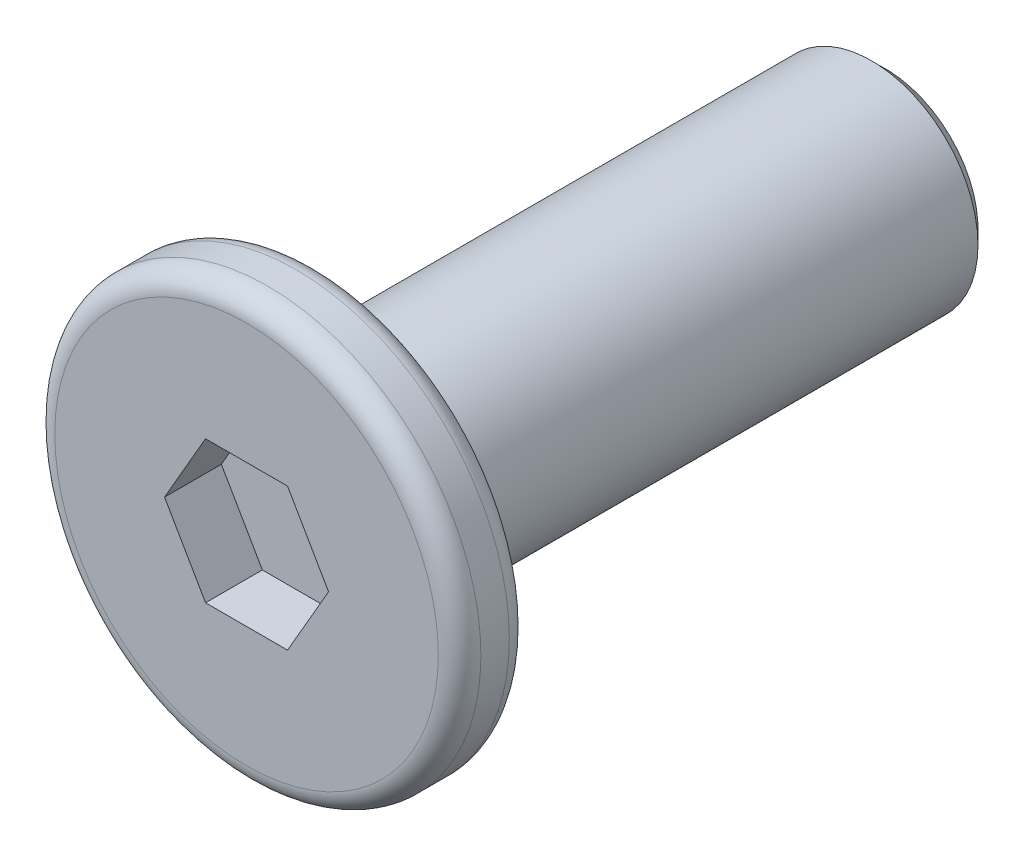
ISO-10303-21;
HEADER;
FILE_DESCRIPTION(('STEP AP214'),'2;1');
FILE_NAME('part.step','',(''),(''),'','','');
FILE_SCHEMA(('AUTOMOTIVE_DESIGN { 1 0 10303 214 1 1 1 1 }'));
ENDSEC;
DATA;
#1=APPLICATION_CONTEXT('core data for automotive mechanical design processes');
#2=APPLICATION_PROTOCOL_DEFINITION('international standard','automotive_design',2000,#1);
#3=PRODUCT_CONTEXT('',#1,'mechanical');
#4=PRODUCT('Part','Part','',(#3));
#5=PRODUCT_RELATED_PRODUCT_CATEGORY('part','',(#4));
#6=PRODUCT_DEFINITION_FORMATION('','',#4);
#7=PRODUCT_DEFINITION_CONTEXT('part definition',#1,'design');
#8=PRODUCT_DEFINITION('design','',#6,#7);
#9=PRODUCT_DEFINITION_SHAPE('','',#8);
#10=(LENGTH_UNIT() NAMED_UNIT(*) SI_UNIT(.MILLI.,.METRE.));
#11=(NAMED_UNIT(*) PLANE_ANGLE_UNIT() SI_UNIT($,.RADIAN.));
#12=(NAMED_UNIT(*) SI_UNIT($,.STERADIAN.) SOLID_ANGLE_UNIT());
#13=UNCERTAINTY_MEASURE_WITH_UNIT(LENGTH_MEASURE(1.E-05),#10,'distance_accuracy_value','');
#14=(GEOMETRIC_REPRESENTATION_CONTEXT(3) GLOBAL_UNCERTAINTY_ASSIGNED_CONTEXT((#13)) GLOBAL_UNIT_ASSIGNED_CONTEXT((#10,
#11,#12)) REPRESENTATION_CONTEXT('',''));
#15=CARTESIAN_POINT('',(0.,0.,0.));
#16=DIRECTION('',(0.,0.,1.));
#17=DIRECTION('',(1.,0.,0.));
#18=AXIS2_PLACEMENT_3D('',#15,#16,#17);
#19=CARTESIAN_POINT('',(0.,0.,0.5));
#20=DIRECTION('',(0.,0.,-1.));
#21=DIRECTION('',(-1.,0.,0.));
#22=AXIS2_PLACEMENT_3D('',#19,#20,#21);
#23=CYLINDRICAL_SURFACE('',#22,3.);
#24=CARTESIAN_POINT('',(0.,0.,-0.2));
#25=DIRECTION('',(0.,0.,1.));
#26=DIRECTION('',(1.,0.,0.));
#27=AXIS2_PLACEMENT_3D('',#24,#25,#26);
#28=CIRCLE('',#27,3.);
#29=CARTESIAN_POINT('',(3.,0.,-0.2));
#30=VERTEX_POINT('',#29);
#31=EDGE_CURVE('E154',#30,#30,#28,.T.);
#32=ORIENTED_EDGE('',*,*,#31,.T.);
#33=EDGE_LOOP('',(#32));
#34=FACE_BOUND('',#33,.T.);
#35=CARTESIAN_POINT('',(0.,0.,0.2));
#36=DIRECTION('',(0.,0.,1.));
#37=DIRECTION('',(1.,0.,0.));
#38=AXIS2_PLACEMENT_3D('',#35,#36,#37);
#39=CIRCLE('',#38,3.);
#40=CARTESIAN_POINT('',(3.,0.,0.2));
#41=VERTEX_POINT('',#40);
#42=EDGE_CURVE('E151',#41,#41,#39,.F.);
#43=ORIENTED_EDGE('',*,*,#42,.T.);
#44=EDGE_LOOP('',(#43));
#45=FACE_BOUND('',#44,.T.);
#46=ADVANCED_FACE('F35',(#34,#45),#23,.T.);
#47=CARTESIAN_POINT('',(0.,0.,0.5));
#48=DIRECTION('',(0.,0.,1.));
#49=DIRECTION('',(1.,0.,0.));
#50=AXIS2_PLACEMENT_3D('',#47,#48,#49);
#51=PLANE('',#50);
#52=CARTESIAN_POINT('',(0.,0.,0.5));
#53=DIRECTION('',(0.,0.,1.));
#54=DIRECTION('',(1.,0.,0.));
#55=AXIS2_PLACEMENT_3D('',#52,#53,#54);
#56=CIRCLE('',#55,2.7);
#57=CARTESIAN_POINT('',(2.7,0.,0.5));
#58=VERTEX_POINT('',#57);
#59=EDGE_CURVE('E11',#58,#58,#56,.T.);
#60=ORIENTED_EDGE('',*,*,#59,.T.);
#61=EDGE_LOOP('',(#60));
#62=FACE_BOUND('',#61,.T.);
#63=DIRECTION('',(0.5,0.866025403784439,0.));
#64=VECTOR('',#63,1.);
#65=CARTESIAN_POINT('',(0.577350269189626,-1.,0.5));
#66=LINE('',#65,#64);
#67=CARTESIAN_POINT('',(0.577350269189626,-1.,0.5));
#68=VERTEX_POINT('',#67);
#69=CARTESIAN_POINT('',(1.15470053837925,0.,0.5));
#70=VERTEX_POINT('',#69);
#71=EDGE_CURVE('E50',#68,#70,#66,.T.);
#72=ORIENTED_EDGE('',*,*,#71,.F.);
#73=DIRECTION('',(1.,0.,0.));
#74=VECTOR('',#73,1.);
#75=CARTESIAN_POINT('',(-0.577350269189625,-1.,0.5));
#76=LINE('',#75,#74);
#77=CARTESIAN_POINT('',(-0.577350269189625,-1.,0.5));
#78=VERTEX_POINT('',#77);
#79=EDGE_CURVE('E133',#78,#68,#76,.T.);
#80=ORIENTED_EDGE('',*,*,#79,.F.);
#81=DIRECTION('',(0.5,-0.866025403784438,0.));
#82=VECTOR('',#81,1.);
#83=CARTESIAN_POINT('',(-1.15470053837925,0.,0.5));
#84=LINE('',#83,#82);
#85=CARTESIAN_POINT('',(-1.15470053837925,0.,0.5));
#86=VERTEX_POINT('',#85);
#87=EDGE_CURVE('E131',#86,#78,#84,.T.);
#88=ORIENTED_EDGE('',*,*,#87,.F.);
#89=DIRECTION('',(-0.5,-0.866025403784438,0.));
#90=VECTOR('',#89,1.);
#91=CARTESIAN_POINT('',(-0.577350269189626,1.,0.5));
#92=LINE('',#91,#90);
#93=CARTESIAN_POINT('',(-0.577350269189626,1.,0.5));
#94=VERTEX_POINT('',#93);
#95=EDGE_CURVE('E98',#94,#86,#92,.T.);
#96=ORIENTED_EDGE('',*,*,#95,.F.);
#97=DIRECTION('',(-1.,0.,0.));
#98=VECTOR('',#97,1.);
#99=CARTESIAN_POINT('',(0.577350269189625,1.,0.5));
#100=LINE('',#99,#98);
#101=CARTESIAN_POINT('',(0.577350269189625,1.,0.5));
#102=VERTEX_POINT('',#101);
#103=EDGE_CURVE('E127',#102,#94,#100,.T.);
#104=ORIENTED_EDGE('',*,*,#103,.F.);
#105=DIRECTION('',(-0.5,0.866025403784438,0.));
#106=VECTOR('',#105,1.);
#107=CARTESIAN_POINT('',(1.15470053837925,0.,0.5));
#108=LINE('',#107,#106);
#109=EDGE_CURVE('E124',#70,#102,#108,.T.);
#110=ORIENTED_EDGE('',*,*,#109,.F.);
#111=EDGE_LOOP('',(#72,#80,#88,#96,#104,#110));
#112=FACE_BOUND('',#111,.T.);
#113=ADVANCED_FACE('F169',(#62,#112),#51,.T.);
#114=CARTESIAN_POINT('',(0.,0.,-0.5));
#115=DIRECTION('',(0.,0.,1.));
#116=DIRECTION('',(1.,0.,0.));
#117=AXIS2_PLACEMENT_3D('',#114,#115,#116);
#118=PLANE('',#117);
#119=CARTESIAN_POINT('',(0.,0.,-0.5));
#120=DIRECTION('',(0.,0.,1.));
#121=DIRECTION('',(1.,0.,0.));
#122=AXIS2_PLACEMENT_3D('',#119,#120,#121);
#123=CIRCLE('',#122,2.7);
#124=CARTESIAN_POINT('',(2.7,0.,-0.5));
#125=VERTEX_POINT('',#124);
#126=EDGE_CURVE('E43',#125,#125,#123,.F.);
#127=ORIENTED_EDGE('',*,*,#126,.T.);
#128=EDGE_LOOP('',(#127));
#129=FACE_BOUND('',#128,.T.);
#130=CARTESIAN_POINT('',(0.,0.,-0.5));
#131=DIRECTION('',(0.,0.,-1.));
#132=DIRECTION('',(-1.,0.,0.));
#133=AXIS2_PLACEMENT_3D('',#130,#131,#132);
#134=CIRCLE('',#133,1.5);
#135=CARTESIAN_POINT('',(-1.5,0.,-0.5));
#136=VERTEX_POINT('',#135);
#137=EDGE_CURVE('E137',#136,#136,#134,.T.);
#138=ORIENTED_EDGE('',*,*,#137,.F.);
#139=EDGE_LOOP('',(#138));
#140=FACE_BOUND('',#139,.T.);
#141=ADVANCED_FACE('F159',(#129,#140),#118,.F.);
#142=CARTESIAN_POINT('',(0.,0.,-8.5));
#143=DIRECTION('',(0.,0.,1.));
#144=DIRECTION('',(1.,0.,0.));
#145=AXIS2_PLACEMENT_3D('',#142,#143,#144);
#146=CYLINDRICAL_SURFACE('',#145,1.5);
#147=CARTESIAN_POINT('',(0.,0.,-8.3));
#148=DIRECTION('',(0.,0.,-1.));
#149=DIRECTION('',(-1.,0.,0.));
#150=AXIS2_PLACEMENT_3D('',#147,#148,#149);
#151=CIRCLE('',#150,1.5);
#152=CARTESIAN_POINT('',(-1.5,0.,-8.3));
#153=VERTEX_POINT('',#152);
#154=EDGE_CURVE('E148',#153,#153,#151,.F.);
#155=ORIENTED_EDGE('',*,*,#154,.T.);
#156=EDGE_LOOP('',(#155));
#157=FACE_BOUND('',#156,.T.);
#158=ORIENTED_EDGE('',*,*,#137,.T.);
#159=EDGE_LOOP('',(#158));
#160=FACE_BOUND('',#159,.T.);
#161=ADVANCED_FACE('F204',(#157,#160),#146,.T.);
#162=CARTESIAN_POINT('',(0.,0.,-8.5));
#163=DIRECTION('',(0.,0.,-1.));
#164=DIRECTION('',(-1.,0.,0.));
#165=AXIS2_PLACEMENT_3D('',#162,#163,#164);
#166=PLANE('',#165);
#167=CARTESIAN_POINT('',(0.,0.,-8.5));
#168=DIRECTION('',(0.,0.,-1.));
#169=DIRECTION('',(-1.,0.,0.));
#170=AXIS2_PLACEMENT_3D('',#167,#168,#169);
#171=CIRCLE('',#170,1.3);
#172=CARTESIAN_POINT('',(-1.3,0.,-8.5));
#173=VERTEX_POINT('',#172);
#174=EDGE_CURVE('E145',#173,#173,#171,.T.);
#175=ORIENTED_EDGE('',*,*,#174,.T.);
#176=EDGE_LOOP('',(#175));
#177=FACE_BOUND('',#176,.T.);
#178=ADVANCED_FACE('F196',(#177),#166,.T.);
#179=CARTESIAN_POINT('',(0.,0.,-8.5));
#180=DIRECTION('',(0.,0.,1.));
#181=DIRECTION('',(1.,0.,0.));
#182=AXIS2_PLACEMENT_3D('',#179,#180,#181);
#183=CONICAL_SURFACE('',#182,1.3,0.78539816339745);
#184=ORIENTED_EDGE('',*,*,#154,.F.);
#185=EDGE_LOOP('',(#184));
#186=FACE_BOUND('',#185,.T.);
#187=ORIENTED_EDGE('',*,*,#174,.F.);
#188=EDGE_LOOP('',(#187));
#189=FACE_BOUND('',#188,.T.);
#190=ADVANCED_FACE('F189',(#186,#189),#183,.T.);
#191=CARTESIAN_POINT('',(0.577350269189626,-1.,-0.3));
#192=DIRECTION('',(0.866025403784439,-0.5,0.));
#193=DIRECTION('',(0.5,0.866025403784439,0.));
#194=AXIS2_PLACEMENT_3D('',#191,#192,#193);
#195=PLANE('',#194);
#196=ORIENTED_EDGE('',*,*,#71,.T.);
#197=DIRECTION('',(0.,0.,1.));
#198=VECTOR('',#197,1.);
#199=CARTESIAN_POINT('',(1.15470053837925,0.,-0.3));
#200=LINE('',#199,#198);
#201=CARTESIAN_POINT('',(1.15470053837925,0.,-0.3));
#202=VERTEX_POINT('',#201);
#203=EDGE_CURVE('E80',#202,#70,#200,.T.);
#204=ORIENTED_EDGE('',*,*,#203,.F.);
#205=DIRECTION('',(0.5,0.866025403784439,0.));
#206=VECTOR('',#205,1.);
#207=CARTESIAN_POINT('',(0.577350269189626,-1.,-0.3));
#208=LINE('',#207,#206);
#209=CARTESIAN_POINT('',(0.577350269189626,-1.,-0.3));
#210=VERTEX_POINT('',#209);
#211=EDGE_CURVE('E135',#210,#202,#208,.T.);
#212=ORIENTED_EDGE('',*,*,#211,.F.);
#213=DIRECTION('',(0.,0.,1.));
#214=VECTOR('',#213,1.);
#215=CARTESIAN_POINT('',(0.577350269189626,-1.,-0.3));
#216=LINE('',#215,#214);
#217=EDGE_CURVE('E58',#210,#68,#216,.T.);
#218=ORIENTED_EDGE('',*,*,#217,.T.);
#219=EDGE_LOOP('',(#196,#204,#212,#218));
#220=FACE_BOUND('',#219,.T.);
#221=ADVANCED_FACE('F186',(#220),#195,.F.);
#222=CARTESIAN_POINT('',(-0.577350269189625,-1.,-0.3));
#223=DIRECTION('',(0.,-1.,0.));
#224=DIRECTION('',(1.,0.,0.));
#225=AXIS2_PLACEMENT_3D('',#222,#223,#224);
#226=PLANE('',#225);
#227=ORIENTED_EDGE('',*,*,#79,.T.);
#228=ORIENTED_EDGE('',*,*,#217,.F.);
#229=DIRECTION('',(1.,0.,0.));
#230=VECTOR('',#229,1.);
#231=CARTESIAN_POINT('',(-0.577350269189625,-1.,-0.3));
#232=LINE('',#231,#230);
#233=CARTESIAN_POINT('',(-0.577350269189625,-1.,-0.3));
#234=VERTEX_POINT('',#233);
#235=EDGE_CURVE('E110',#234,#210,#232,.T.);
#236=ORIENTED_EDGE('',*,*,#235,.F.);
#237=DIRECTION('',(0.,0.,1.));
#238=VECTOR('',#237,1.);
#239=CARTESIAN_POINT('',(-0.577350269189625,-1.,-0.3));
#240=LINE('',#239,#238);
#241=EDGE_CURVE('E102',#234,#78,#240,.T.);
#242=ORIENTED_EDGE('',*,*,#241,.T.);
#243=EDGE_LOOP('',(#227,#228,#236,#242));
#244=FACE_BOUND('',#243,.T.);
#245=ADVANCED_FACE('F188',(#244),#226,.F.);
#246=CARTESIAN_POINT('',(-1.15470053837925,0.,-0.3));
#247=DIRECTION('',(-0.866025403784438,-0.5,0.));
#248=DIRECTION('',(0.5,-0.866025403784438,0.));
#249=AXIS2_PLACEMENT_3D('',#246,#247,#248);
#250=PLANE('',#249);
#251=ORIENTED_EDGE('',*,*,#87,.T.);
#252=ORIENTED_EDGE('',*,*,#241,.F.);
#253=DIRECTION('',(0.5,-0.866025403784438,0.));
#254=VECTOR('',#253,1.);
#255=CARTESIAN_POINT('',(-1.15470053837925,0.,-0.3));
#256=LINE('',#255,#254);
#257=CARTESIAN_POINT('',(-1.15470053837925,0.,-0.3));
#258=VERTEX_POINT('',#257);
#259=EDGE_CURVE('E106',#258,#234,#256,.T.);
#260=ORIENTED_EDGE('',*,*,#259,.F.);
#261=DIRECTION('',(0.,0.,1.));
#262=VECTOR('',#261,1.);
#263=CARTESIAN_POINT('',(-1.15470053837925,0.,-0.3));
#264=LINE('',#263,#262);
#265=EDGE_CURVE('E91',#258,#86,#264,.T.);
#266=ORIENTED_EDGE('',*,*,#265,.T.);
#267=EDGE_LOOP('',(#251,#252,#260,#266));
#268=FACE_BOUND('',#267,.T.);
#269=ADVANCED_FACE('F107',(#268),#250,.F.);
#270=CARTESIAN_POINT('',(-0.577350269189626,1.,-0.3));
#271=DIRECTION('',(-0.866025403784438,0.5,0.));
#272=DIRECTION('',(-0.5,-0.866025403784439,0.));
#273=AXIS2_PLACEMENT_3D('',#270,#271,#272);
#274=PLANE('',#273);
#275=ORIENTED_EDGE('',*,*,#95,.T.);
#276=ORIENTED_EDGE('',*,*,#265,.F.);
#277=DIRECTION('',(-0.5,-0.866025403784438,0.));
#278=VECTOR('',#277,1.);
#279=CARTESIAN_POINT('',(-0.577350269189626,1.,-0.3));
#280=LINE('',#279,#278);
#281=CARTESIAN_POINT('',(-0.577350269189626,1.,-0.3));
#282=VERTEX_POINT('',#281);
#283=EDGE_CURVE('E95',#282,#258,#280,.T.);
#284=ORIENTED_EDGE('',*,*,#283,.F.);
#285=DIRECTION('',(0.,0.,1.));
#286=VECTOR('',#285,1.);
#287=CARTESIAN_POINT('',(-0.577350269189626,1.,-0.3));
#288=LINE('',#287,#286);
#289=EDGE_CURVE('E103',#282,#94,#288,.T.);
#290=ORIENTED_EDGE('',*,*,#289,.T.);
#291=EDGE_LOOP('',(#275,#276,#284,#290));
#292=FACE_BOUND('',#291,.T.);
#293=ADVANCED_FACE('F93',(#292),#274,.F.);
#294=CARTESIAN_POINT('',(0.577350269189625,1.,-0.3));
#295=DIRECTION('',(0.,1.,0.));
#296=DIRECTION('',(0.,0.,1.));
#297=AXIS2_PLACEMENT_3D('',#294,#295,#296);
#298=PLANE('',#297);
#299=ORIENTED_EDGE('',*,*,#103,.T.);
#300=ORIENTED_EDGE('',*,*,#289,.F.);
#301=DIRECTION('',(-1.,0.,0.));
#302=VECTOR('',#301,1.);
#303=CARTESIAN_POINT('',(0.577350269189625,1.,-0.3));
#304=LINE('',#303,#302);
#305=CARTESIAN_POINT('',(0.577350269189625,1.,-0.3));
#306=VERTEX_POINT('',#305);
#307=EDGE_CURVE('E116',#306,#282,#304,.T.);
#308=ORIENTED_EDGE('',*,*,#307,.F.);
#309=DIRECTION('',(0.,0.,1.));
#310=VECTOR('',#309,1.);
#311=CARTESIAN_POINT('',(0.577350269189625,1.,-0.3));
#312=LINE('',#311,#310);
#313=EDGE_CURVE('E140',#306,#102,#312,.T.);
#314=ORIENTED_EDGE('',*,*,#313,.T.);
#315=EDGE_LOOP('',(#299,#300,#308,#314));
#316=FACE_BOUND('',#315,.T.);
#317=ADVANCED_FACE('F257',(#316),#298,.F.);
#318=CARTESIAN_POINT('',(1.15470053837925,0.,-0.3));
#319=DIRECTION('',(0.866025403784438,0.5,0.));
#320=DIRECTION('',(-0.5,0.866025403784439,0.));
#321=AXIS2_PLACEMENT_3D('',#318,#319,#320);
#322=PLANE('',#321);
#323=ORIENTED_EDGE('',*,*,#109,.T.);
#324=ORIENTED_EDGE('',*,*,#313,.F.);
#325=DIRECTION('',(-0.5,0.866025403784438,0.));
#326=VECTOR('',#325,1.);
#327=CARTESIAN_POINT('',(1.15470053837925,0.,-0.3));
#328=LINE('',#327,#326);
#329=EDGE_CURVE('E118',#202,#306,#328,.T.);
#330=ORIENTED_EDGE('',*,*,#329,.F.);
#331=ORIENTED_EDGE('',*,*,#203,.T.);
#332=EDGE_LOOP('',(#323,#324,#330,#331));
#333=FACE_BOUND('',#332,.T.);
#334=ADVANCED_FACE('F184',(#333),#322,.F.);
#335=CARTESIAN_POINT('',(0.,0.,-0.3));
#336=DIRECTION('',(0.,0.,1.));
#337=DIRECTION('',(1.,0.,0.));
#338=AXIS2_PLACEMENT_3D('',#335,#336,#337);
#339=PLANE('',#338);
#340=ORIENTED_EDGE('',*,*,#211,.T.);
#341=ORIENTED_EDGE('',*,*,#329,.T.);
#342=ORIENTED_EDGE('',*,*,#307,.T.);
#343=ORIENTED_EDGE('',*,*,#283,.T.);
#344=ORIENTED_EDGE('',*,*,#259,.T.);
#345=ORIENTED_EDGE('',*,*,#235,.T.);
#346=EDGE_LOOP('',(#340,#341,#342,#343,#344,#345));
#347=FACE_BOUND('',#346,.T.);
#348=ADVANCED_FACE('F113',(#347),#339,.T.);
#349=CARTESIAN_POINT('',(0.,0.,-0.2));
#350=DIRECTION('',(0.,0.,1.));
#351=DIRECTION('',(1.,0.,0.));
#352=AXIS2_PLACEMENT_3D('',#349,#350,#351);
#353=TOROIDAL_SURFACE('',#352,2.7,0.3);
#354=ORIENTED_EDGE('',*,*,#126,.F.);
#355=EDGE_LOOP('',(#354));
#356=FACE_BOUND('',#355,.T.);
#357=ORIENTED_EDGE('',*,*,#31,.F.);
#358=EDGE_LOOP('',(#357));
#359=FACE_BOUND('',#358,.T.);
#360=ADVANCED_FACE('F162',(#356,#359),#353,.T.);
#361=CARTESIAN_POINT('',(0.,0.,0.2));
#362=DIRECTION('',(0.,0.,1.));
#363=DIRECTION('',(1.,0.,0.));
#364=AXIS2_PLACEMENT_3D('',#361,#362,#363);
#365=TOROIDAL_SURFACE('',#364,2.7,0.3);
#366=ORIENTED_EDGE('',*,*,#42,.F.);
#367=EDGE_LOOP('',(#366));
#368=FACE_BOUND('',#367,.T.);
#369=ORIENTED_EDGE('',*,*,#59,.F.);
#370=EDGE_LOOP('',(#369));
#371=FACE_BOUND('',#370,.T.);
#372=ADVANCED_FACE('F37',(#368,#371),#365,.T.);
#373=CLOSED_SHELL('',(#46,#113,#141,#161,#178,#190,#221,#245,#269,#293,#317,#334,#348,#360,#372));
#374=MANIFOLD_SOLID_BREP('B2',#373);
#375=ADVANCED_BREP_SHAPE_REPRESENTATION('',(#18,#374),#14);
#376=SHAPE_DEFINITION_REPRESENTATION(#9,#375);
ENDSEC;
END-ISO-10303-21;
